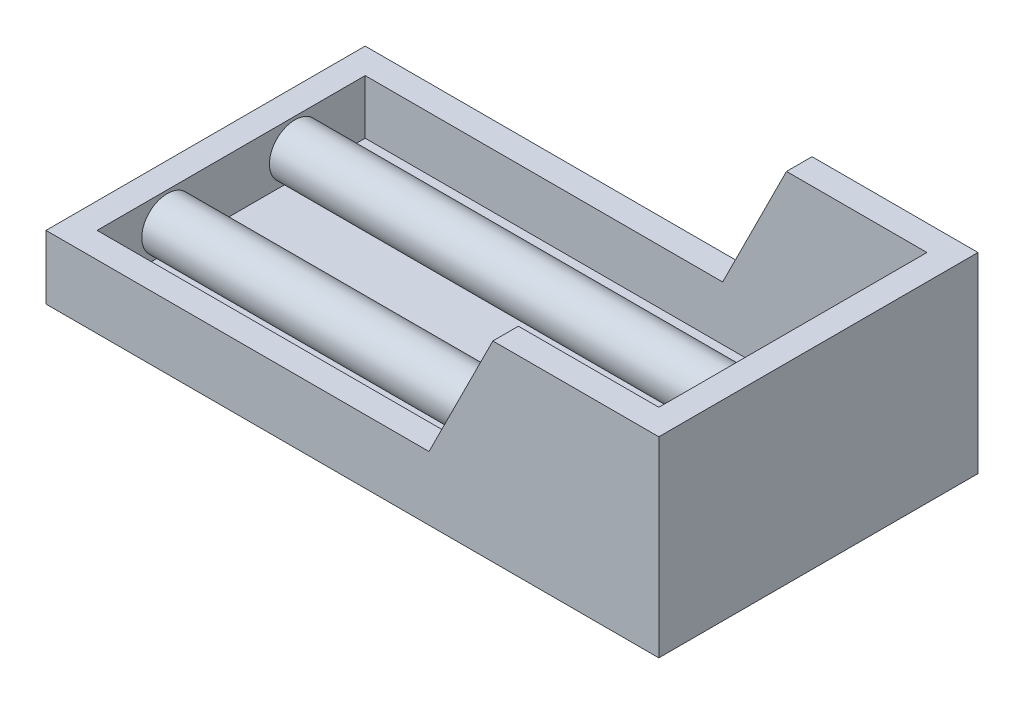
ISO-10303-21;
HEADER;
FILE_DESCRIPTION(('STEP AP214'),'2;1');
FILE_NAME('part.step','',(''),(''),'','','');
FILE_SCHEMA(('AUTOMOTIVE_DESIGN { 1 0 10303 214 1 1 1 1 }'));
ENDSEC;
DATA;
#1=APPLICATION_CONTEXT('core data for automotive mechanical design processes');
#2=APPLICATION_PROTOCOL_DEFINITION('international standard','automotive_design',2000,#1);
#3=PRODUCT_CONTEXT('',#1,'mechanical');
#4=PRODUCT('Part','Part','',(#3));
#5=PRODUCT_RELATED_PRODUCT_CATEGORY('part','',(#4));
#6=PRODUCT_DEFINITION_FORMATION('','',#4);
#7=PRODUCT_DEFINITION_CONTEXT('part definition',#1,'design');
#8=PRODUCT_DEFINITION('design','',#6,#7);
#9=PRODUCT_DEFINITION_SHAPE('','',#8);
#10=(LENGTH_UNIT() NAMED_UNIT(*) SI_UNIT(.MILLI.,.METRE.));
#11=(NAMED_UNIT(*) PLANE_ANGLE_UNIT() SI_UNIT($,.RADIAN.));
#12=(NAMED_UNIT(*) SI_UNIT($,.STERADIAN.) SOLID_ANGLE_UNIT());
#13=UNCERTAINTY_MEASURE_WITH_UNIT(LENGTH_MEASURE(1.E-05),#10,'distance_accuracy_value','');
#14=(GEOMETRIC_REPRESENTATION_CONTEXT(3) GLOBAL_UNCERTAINTY_ASSIGNED_CONTEXT((#13)) GLOBAL_UNIT_ASSIGNED_CONTEXT((#10,
#11,#12)) REPRESENTATION_CONTEXT('',''));
#15=CARTESIAN_POINT('',(0.,0.,0.));
#16=DIRECTION('',(0.,0.,1.));
#17=DIRECTION('',(1.,0.,0.));
#18=AXIS2_PLACEMENT_3D('',#15,#16,#17);
#19=CARTESIAN_POINT('',(-8.,2.75,-2.5));
#20=DIRECTION('',(-1.,0.,0.));
#21=DIRECTION('',(0.,0.,1.));
#22=AXIS2_PLACEMENT_3D('',#19,#20,#21);
#23=PLANE('',#22);
#24=CARTESIAN_POINT('',(-8.,2.75,-2.5));
#25=DIRECTION('',(1.,0.,0.));
#26=DIRECTION('',(0.,0.,1.));
#27=AXIS2_PLACEMENT_3D('',#24,#25,#26);
#28=CIRCLE('',#27,2.);
#29=CARTESIAN_POINT('',(-8.,2.75,-0.500000000000004));
#30=VERTEX_POINT('',#29);
#31=EDGE_CURVE('E57',#30,#30,#28,.T.);
#32=ORIENTED_EDGE('',*,*,#31,.F.);
#33=EDGE_LOOP('',(#32));
#34=FACE_BOUND('',#33,.T.);
#35=ADVANCED_FACE('F46',(#34),#23,.T.);
#36=CARTESIAN_POINT('',(41.6568542494924,2.75,-2.5));
#37=DIRECTION('',(-1.,0.,0.));
#38=DIRECTION('',(0.,0.,1.));
#39=AXIS2_PLACEMENT_3D('',#36,#37,#38);
#40=CYLINDRICAL_SURFACE('',#39,2.);
#41=CARTESIAN_POINT('',(35.,2.75,-2.5));
#42=DIRECTION('',(-1.,0.,0.));
#43=DIRECTION('',(0.,0.,1.));
#44=AXIS2_PLACEMENT_3D('',#41,#42,#43);
#45=CIRCLE('',#44,2.);
#46=CARTESIAN_POINT('',(35.,2.75,-0.500000000000004));
#47=VERTEX_POINT('',#46);
#48=EDGE_CURVE('E53',#47,#47,#45,.T.);
#49=ORIENTED_EDGE('',*,*,#48,.T.);
#50=EDGE_LOOP('',(#49));
#51=FACE_BOUND('',#50,.T.);
#52=ORIENTED_EDGE('',*,*,#31,.T.);
#53=EDGE_LOOP('',(#52));
#54=FACE_BOUND('',#53,.T.);
#55=ADVANCED_FACE('F64',(#51,#54),#40,.T.);
#56=CARTESIAN_POINT('',(36.,15.,-18.));
#57=DIRECTION('',(-1.,0.,0.));
#58=DIRECTION('',(0.,0.,1.));
#59=AXIS2_PLACEMENT_3D('',#56,#57,#58);
#60=PLANE('',#59);
#61=CARTESIAN_POINT('',(36.,2.75,-2.5));
#62=DIRECTION('',(-1.,0.,0.));
#63=DIRECTION('',(0.,0.,1.));
#64=AXIS2_PLACEMENT_3D('',#61,#62,#63);
#65=CIRCLE('',#64,1.);
#66=CARTESIAN_POINT('',(36.,2.75,-1.5));
#67=VERTEX_POINT('',#66);
#68=EDGE_CURVE('E11',#67,#67,#65,.F.);
#69=ORIENTED_EDGE('',*,*,#68,.T.);
#70=EDGE_LOOP('',(#69));
#71=FACE_BOUND('',#70,.T.);
#72=ADVANCED_FACE('F71',(#71),#60,.F.);
#73=CARTESIAN_POINT('',(35.,2.75,-2.5));
#74=DIRECTION('',(-1.,0.,0.));
#75=DIRECTION('',(0.,0.,1.));
#76=AXIS2_PLACEMENT_3D('',#73,#74,#75);
#77=TOROIDAL_SURFACE('',#76,1.,1.);
#78=ORIENTED_EDGE('',*,*,#68,.F.);
#79=EDGE_LOOP('',(#78));
#80=FACE_BOUND('',#79,.T.);
#81=ORIENTED_EDGE('',*,*,#48,.F.);
#82=EDGE_LOOP('',(#81));
#83=FACE_BOUND('',#82,.T.);
#84=ADVANCED_FACE('F48',(#80,#83),#77,.T.);
#85=CLOSED_SHELL('',(#35,#55,#72,#84));
#86=MANIFOLD_SOLID_BREP('B2',#85);
#87=CARTESIAN_POINT('',(-8.,2.75,-12.5));
#88=DIRECTION('',(1.,0.,0.));
#89=DIRECTION('',(0.,0.,-1.));
#90=AXIS2_PLACEMENT_3D('',#87,#88,#89);
#91=PLANE('',#90);
#92=CARTESIAN_POINT('',(-8.,2.75,-12.5));
#93=DIRECTION('',(1.,0.,0.));
#94=DIRECTION('',(0.,0.,-1.));
#95=AXIS2_PLACEMENT_3D('',#92,#93,#94);
#96=CIRCLE('',#95,2.);
#97=CARTESIAN_POINT('',(-8.,2.75,-14.5));
#98=VERTEX_POINT('',#97);
#99=EDGE_CURVE('E124',#98,#98,#96,.T.);
#100=ORIENTED_EDGE('',*,*,#99,.F.);
#101=EDGE_LOOP('',(#100));
#102=FACE_BOUND('',#101,.T.);
#103=ADVANCED_FACE('F113',(#102),#91,.F.);
#104=CARTESIAN_POINT('',(41.6568542494924,2.75,-12.5));
#105=DIRECTION('',(-1.,0.,0.));
#106=DIRECTION('',(0.,0.,1.));
#107=AXIS2_PLACEMENT_3D('',#104,#105,#106);
#108=CYLINDRICAL_SURFACE('',#107,2.);
#109=CARTESIAN_POINT('',(35.,2.75,-12.5));
#110=DIRECTION('',(-1.,0.,0.));
#111=DIRECTION('',(0.,0.,1.));
#112=AXIS2_PLACEMENT_3D('',#109,#110,#111);
#113=CIRCLE('',#112,2.);
#114=CARTESIAN_POINT('',(35.,2.75,-10.5));
#115=VERTEX_POINT('',#114);
#116=EDGE_CURVE('E120',#115,#115,#113,.T.);
#117=ORIENTED_EDGE('',*,*,#116,.T.);
#118=EDGE_LOOP('',(#117));
#119=FACE_BOUND('',#118,.T.);
#120=ORIENTED_EDGE('',*,*,#99,.T.);
#121=EDGE_LOOP('',(#120));
#122=FACE_BOUND('',#121,.T.);
#123=ADVANCED_FACE('F131',(#119,#122),#108,.T.);
#124=CARTESIAN_POINT('',(36.,15.,-18.));
#125=DIRECTION('',(-1.,0.,0.));
#126=DIRECTION('',(0.,0.,1.));
#127=AXIS2_PLACEMENT_3D('',#124,#125,#126);
#128=PLANE('',#127);
#129=CARTESIAN_POINT('',(36.,2.75,-12.5));
#130=DIRECTION('',(-1.,0.,0.));
#131=DIRECTION('',(0.,0.,1.));
#132=AXIS2_PLACEMENT_3D('',#129,#130,#131);
#133=CIRCLE('',#132,0.999999999999997);
#134=CARTESIAN_POINT('',(36.,2.75,-11.5));
#135=VERTEX_POINT('',#134);
#136=EDGE_CURVE('E45',#135,#135,#133,.F.);
#137=ORIENTED_EDGE('',*,*,#136,.T.);
#138=EDGE_LOOP('',(#137));
#139=FACE_BOUND('',#138,.T.);
#140=ADVANCED_FACE('F138',(#139),#128,.F.);
#141=CARTESIAN_POINT('',(35.,2.75,-12.5));
#142=DIRECTION('',(-1.,0.,0.));
#143=DIRECTION('',(0.,0.,1.));
#144=AXIS2_PLACEMENT_3D('',#141,#142,#143);
#145=DEGENERATE_TOROIDAL_SURFACE('',#144,0.999999999999997,1.,.T.);
#146=ORIENTED_EDGE('',*,*,#136,.F.);
#147=EDGE_LOOP('',(#146));
#148=FACE_BOUND('',#147,.T.);
#149=ORIENTED_EDGE('',*,*,#116,.F.);
#150=EDGE_LOOP('',(#149));
#151=FACE_BOUND('',#150,.T.);
#152=ADVANCED_FACE('F115',(#148,#151),#145,.T.);
#153=CLOSED_SHELL('',(#103,#123,#140,#152));
#154=MANIFOLD_SOLID_BREP('B6',#153);
#155=CARTESIAN_POINT('',(0.,15.,0.));
#156=DIRECTION('',(0.,1.,0.));
#157=DIRECTION('',(0.,0.,1.));
#158=AXIS2_PLACEMENT_3D('',#155,#156,#157);
#159=PLANE('',#158);
#160=DIRECTION('',(0.,0.,1.));
#161=VECTOR('',#160,1.);
#162=CARTESIAN_POINT('',(25.,15.,-20.));
#163=LINE('',#162,#161);
#164=CARTESIAN_POINT('',(25.,15.,-20.));
#165=VERTEX_POINT('',#164);
#166=CARTESIAN_POINT('',(25.,15.,-18.));
#167=VERTEX_POINT('',#166);
#168=EDGE_CURVE('E285',#165,#167,#163,.T.);
#169=ORIENTED_EDGE('',*,*,#168,.T.);
#170=DIRECTION('',(-1.,0.,0.));
#171=VECTOR('',#170,1.);
#172=CARTESIAN_POINT('',(-8.,15.,-18.));
#173=LINE('',#172,#171);
#174=CARTESIAN_POINT('',(36.,15.,-18.));
#175=VERTEX_POINT('',#174);
#176=EDGE_CURVE('E272',#175,#167,#173,.T.);
#177=ORIENTED_EDGE('',*,*,#176,.F.);
#178=DIRECTION('',(0.,0.,-1.));
#179=VECTOR('',#178,1.);
#180=CARTESIAN_POINT('',(36.,15.,-18.));
#181=LINE('',#180,#179);
#182=CARTESIAN_POINT('',(36.,15.,3.));
#183=VERTEX_POINT('',#182);
#184=EDGE_CURVE('E263',#183,#175,#181,.T.);
#185=ORIENTED_EDGE('',*,*,#184,.F.);
#186=DIRECTION('',(1.,0.,0.));
#187=VECTOR('',#186,1.);
#188=CARTESIAN_POINT('',(-8.,15.,3.));
#189=LINE('',#188,#187);
#190=CARTESIAN_POINT('',(25.,15.,3.));
#191=VERTEX_POINT('',#190);
#192=EDGE_CURVE('E286',#191,#183,#189,.T.);
#193=ORIENTED_EDGE('',*,*,#192,.F.);
#194=CARTESIAN_POINT('',(25.,15.,5.));
#195=VERTEX_POINT('',#194);
#196=EDGE_CURVE('E196',#191,#195,#163,.T.);
#197=ORIENTED_EDGE('',*,*,#196,.T.);
#198=DIRECTION('',(1.,0.,0.));
#199=VECTOR('',#198,1.);
#200=CARTESIAN_POINT('',(-10.,15.,5.));
#201=LINE('',#200,#199);
#202=CARTESIAN_POINT('',(38.,15.,5.));
#203=VERTEX_POINT('',#202);
#204=EDGE_CURVE('E328',#195,#203,#201,.T.);
#205=ORIENTED_EDGE('',*,*,#204,.T.);
#206=DIRECTION('',(0.,0.,-1.));
#207=VECTOR('',#206,1.);
#208=CARTESIAN_POINT('',(38.,15.,-20.));
#209=LINE('',#208,#207);
#210=CARTESIAN_POINT('',(38.,15.,-20.));
#211=VERTEX_POINT('',#210);
#212=EDGE_CURVE('E322',#203,#211,#209,.T.);
#213=ORIENTED_EDGE('',*,*,#212,.T.);
#214=DIRECTION('',(-1.,0.,0.));
#215=VECTOR('',#214,1.);
#216=CARTESIAN_POINT('',(-10.,15.,-20.));
#217=LINE('',#216,#215);
#218=EDGE_CURVE('E325',#211,#165,#217,.T.);
#219=ORIENTED_EDGE('',*,*,#218,.T.);
#220=EDGE_LOOP('',(#169,#177,#185,#193,#197,#205,#213,#219));
#221=FACE_BOUND('',#220,.T.);
#222=ADVANCED_FACE('F173',(#221),#159,.T.);
#223=CARTESIAN_POINT('',(25.,15.,-20.));
#224=DIRECTION('',(0.894427190999916,-0.447213595499958,0.));
#225=DIRECTION('',(0.447213595499958,0.894427190999916,0.));
#226=AXIS2_PLACEMENT_3D('',#223,#224,#225);
#227=PLANE('',#226);
#228=DIRECTION('',(-0.447213595499958,-0.894427190999916,0.));
#229=VECTOR('',#228,1.);
#230=CARTESIAN_POINT('',(25.,15.,-18.));
#231=LINE('',#230,#229);
#232=CARTESIAN_POINT('',(20.,5.,-18.));
#233=VERTEX_POINT('',#232);
#234=EDGE_CURVE('E301',#167,#233,#231,.T.);
#235=ORIENTED_EDGE('',*,*,#234,.F.);
#236=ORIENTED_EDGE('',*,*,#168,.F.);
#237=DIRECTION('',(0.447213595499958,0.894427190999916,0.));
#238=VECTOR('',#237,1.);
#239=CARTESIAN_POINT('',(25.,15.,-20.));
#240=LINE('',#239,#238);
#241=CARTESIAN_POINT('',(20.,5.,-20.));
#242=VERTEX_POINT('',#241);
#243=EDGE_CURVE('E307',#242,#165,#240,.T.);
#244=ORIENTED_EDGE('',*,*,#243,.F.);
#245=DIRECTION('',(0.,0.,1.));
#246=VECTOR('',#245,1.);
#247=CARTESIAN_POINT('',(20.,5.,-20.));
#248=LINE('',#247,#246);
#249=EDGE_CURVE('E317',#242,#233,#248,.T.);
#250=ORIENTED_EDGE('',*,*,#249,.T.);
#251=EDGE_LOOP('',(#235,#236,#244,#250));
#252=FACE_BOUND('',#251,.T.);
#253=ADVANCED_FACE('F380',(#252),#227,.F.);
#254=DIRECTION('',(0.447213595499958,0.894427190999916,0.));
#255=VECTOR('',#254,1.);
#256=CARTESIAN_POINT('',(25.,15.,3.));
#257=LINE('',#256,#255);
#258=CARTESIAN_POINT('',(20.,5.,3.));
#259=VERTEX_POINT('',#258);
#260=EDGE_CURVE('E280',#259,#191,#257,.T.);
#261=ORIENTED_EDGE('',*,*,#260,.F.);
#262=CARTESIAN_POINT('',(20.,5.,5.));
#263=VERTEX_POINT('',#262);
#264=EDGE_CURVE('E320',#259,#263,#248,.T.);
#265=ORIENTED_EDGE('',*,*,#264,.T.);
#266=DIRECTION('',(0.447213595499958,0.894427190999916,0.));
#267=VECTOR('',#266,1.);
#268=CARTESIAN_POINT('',(25.,15.,5.));
#269=LINE('',#268,#267);
#270=EDGE_CURVE('E308',#263,#195,#269,.T.);
#271=ORIENTED_EDGE('',*,*,#270,.T.);
#272=ORIENTED_EDGE('',*,*,#196,.F.);
#273=EDGE_LOOP('',(#261,#265,#271,#272));
#274=FACE_BOUND('',#273,.T.);
#275=ADVANCED_FACE('F363',(#274),#227,.F.);
#276=CARTESIAN_POINT('',(20.,5.,-20.));
#277=DIRECTION('',(0.,-1.,0.));
#278=DIRECTION('',(1.,0.,0.));
#279=AXIS2_PLACEMENT_3D('',#276,#277,#278);
#280=PLANE('',#279);
#281=DIRECTION('',(-1.,0.,0.));
#282=VECTOR('',#281,1.);
#283=CARTESIAN_POINT('',(20.,5.,-18.));
#284=LINE('',#283,#282);
#285=CARTESIAN_POINT('',(-8.,5.,-18.));
#286=VERTEX_POINT('',#285);
#287=EDGE_CURVE('E111',#233,#286,#284,.T.);
#288=ORIENTED_EDGE('',*,*,#287,.F.);
#289=ORIENTED_EDGE('',*,*,#249,.F.);
#290=DIRECTION('',(1.,0.,0.));
#291=VECTOR('',#290,1.);
#292=CARTESIAN_POINT('',(20.,5.,-20.));
#293=LINE('',#292,#291);
#294=CARTESIAN_POINT('',(-10.,5.,-20.));
#295=VERTEX_POINT('',#294);
#296=EDGE_CURVE('E304',#295,#242,#293,.T.);
#297=ORIENTED_EDGE('',*,*,#296,.F.);
#298=DIRECTION('',(0.,0.,1.));
#299=VECTOR('',#298,1.);
#300=CARTESIAN_POINT('',(-10.,5.,-20.));
#301=LINE('',#300,#299);
#302=CARTESIAN_POINT('',(-10.,5.,5.));
#303=VERTEX_POINT('',#302);
#304=EDGE_CURVE('E311',#295,#303,#301,.T.);
#305=ORIENTED_EDGE('',*,*,#304,.T.);
#306=DIRECTION('',(1.,0.,0.));
#307=VECTOR('',#306,1.);
#308=CARTESIAN_POINT('',(20.,5.,5.));
#309=LINE('',#308,#307);
#310=EDGE_CURVE('E303',#303,#263,#309,.T.);
#311=ORIENTED_EDGE('',*,*,#310,.T.);
#312=ORIENTED_EDGE('',*,*,#264,.F.);
#313=DIRECTION('',(1.,0.,0.));
#314=VECTOR('',#313,1.);
#315=CARTESIAN_POINT('',(20.,5.,3.));
#316=LINE('',#315,#314);
#317=CARTESIAN_POINT('',(-8.,5.,3.));
#318=VERTEX_POINT('',#317);
#319=EDGE_CURVE('E349',#318,#259,#316,.T.);
#320=ORIENTED_EDGE('',*,*,#319,.F.);
#321=DIRECTION('',(0.,0.,1.));
#322=VECTOR('',#321,1.);
#323=CARTESIAN_POINT('',(-8.,5.,-20.));
#324=LINE('',#323,#322);
#325=EDGE_CURVE('E181',#286,#318,#324,.T.);
#326=ORIENTED_EDGE('',*,*,#325,.F.);
#327=EDGE_LOOP('',(#288,#289,#297,#305,#311,#312,#320,#326));
#328=FACE_BOUND('',#327,.T.);
#329=ADVANCED_FACE('F359',(#328),#280,.F.);
#330=CARTESIAN_POINT('',(38.,15.,-20.));
#331=DIRECTION('',(-1.,0.,0.));
#332=DIRECTION('',(0.,0.,1.));
#333=AXIS2_PLACEMENT_3D('',#330,#331,#332);
#334=PLANE('',#333);
#335=DIRECTION('',(0.,0.,-1.));
#336=VECTOR('',#335,1.);
#337=CARTESIAN_POINT('',(38.,0.,-20.));
#338=LINE('',#337,#336);
#339=CARTESIAN_POINT('',(38.,0.,5.));
#340=VERTEX_POINT('',#339);
#341=CARTESIAN_POINT('',(38.,0.,-20.));
#342=VERTEX_POINT('',#341);
#343=EDGE_CURVE('E316',#340,#342,#338,.T.);
#344=ORIENTED_EDGE('',*,*,#343,.T.);
#345=DIRECTION('',(0.,-1.,0.));
#346=VECTOR('',#345,1.);
#347=CARTESIAN_POINT('',(38.,15.,-20.));
#348=LINE('',#347,#346);
#349=EDGE_CURVE('E346',#211,#342,#348,.T.);
#350=ORIENTED_EDGE('',*,*,#349,.F.);
#351=ORIENTED_EDGE('',*,*,#212,.F.);
#352=DIRECTION('',(0.,-1.,0.));
#353=VECTOR('',#352,1.);
#354=CARTESIAN_POINT('',(38.,15.,5.));
#355=LINE('',#354,#353);
#356=EDGE_CURVE('E330',#203,#340,#355,.T.);
#357=ORIENTED_EDGE('',*,*,#356,.T.);
#358=EDGE_LOOP('',(#344,#350,#351,#357));
#359=FACE_BOUND('',#358,.T.);
#360=ADVANCED_FACE('F175',(#359),#334,.F.);
#361=CARTESIAN_POINT('',(-10.,15.,-20.));
#362=DIRECTION('',(0.,0.,1.));
#363=DIRECTION('',(1.,0.,0.));
#364=AXIS2_PLACEMENT_3D('',#361,#362,#363);
#365=PLANE('',#364);
#366=ORIENTED_EDGE('',*,*,#296,.T.);
#367=ORIENTED_EDGE('',*,*,#243,.T.);
#368=ORIENTED_EDGE('',*,*,#218,.F.);
#369=ORIENTED_EDGE('',*,*,#349,.T.);
#370=DIRECTION('',(-1.,0.,0.));
#371=VECTOR('',#370,1.);
#372=CARTESIAN_POINT('',(-10.,0.,-20.));
#373=LINE('',#372,#371);
#374=CARTESIAN_POINT('',(-10.,0.,-20.));
#375=VERTEX_POINT('',#374);
#376=EDGE_CURVE('E333',#342,#375,#373,.T.);
#377=ORIENTED_EDGE('',*,*,#376,.T.);
#378=DIRECTION('',(0.,-1.,0.));
#379=VECTOR('',#378,1.);
#380=CARTESIAN_POINT('',(-10.,15.,-20.));
#381=LINE('',#380,#379);
#382=EDGE_CURVE('E344',#295,#375,#381,.T.);
#383=ORIENTED_EDGE('',*,*,#382,.F.);
#384=EDGE_LOOP('',(#366,#367,#368,#369,#377,#383));
#385=FACE_BOUND('',#384,.T.);
#386=ADVANCED_FACE('F375',(#385),#365,.F.);
#387=CARTESIAN_POINT('',(-10.,15.,-20.));
#388=DIRECTION('',(1.,0.,0.));
#389=DIRECTION('',(0.,0.,-1.));
#390=AXIS2_PLACEMENT_3D('',#387,#388,#389);
#391=PLANE('',#390);
#392=DIRECTION('',(0.,-1.,0.));
#393=VECTOR('',#392,1.);
#394=CARTESIAN_POINT('',(-10.,15.,5.));
#395=LINE('',#394,#393);
#396=CARTESIAN_POINT('',(-10.,0.,5.));
#397=VERTEX_POINT('',#396);
#398=EDGE_CURVE('E342',#303,#397,#395,.T.);
#399=ORIENTED_EDGE('',*,*,#398,.F.);
#400=ORIENTED_EDGE('',*,*,#304,.F.);
#401=ORIENTED_EDGE('',*,*,#382,.T.);
#402=DIRECTION('',(0.,0.,1.));
#403=VECTOR('',#402,1.);
#404=CARTESIAN_POINT('',(-10.,0.,-20.));
#405=LINE('',#404,#403);
#406=EDGE_CURVE('E336',#375,#397,#405,.T.);
#407=ORIENTED_EDGE('',*,*,#406,.T.);
#408=EDGE_LOOP('',(#399,#400,#401,#407));
#409=FACE_BOUND('',#408,.T.);
#410=ADVANCED_FACE('F384',(#409),#391,.F.);
#411=CARTESIAN_POINT('',(-10.,15.,5.));
#412=DIRECTION('',(0.,0.,-1.));
#413=DIRECTION('',(-1.,0.,0.));
#414=AXIS2_PLACEMENT_3D('',#411,#412,#413);
#415=PLANE('',#414);
#416=ORIENTED_EDGE('',*,*,#204,.F.);
#417=ORIENTED_EDGE('',*,*,#270,.F.);
#418=ORIENTED_EDGE('',*,*,#310,.F.);
#419=ORIENTED_EDGE('',*,*,#398,.T.);
#420=DIRECTION('',(1.,0.,0.));
#421=VECTOR('',#420,1.);
#422=CARTESIAN_POINT('',(-10.,0.,5.));
#423=LINE('',#422,#421);
#424=EDGE_CURVE('E326',#397,#340,#423,.T.);
#425=ORIENTED_EDGE('',*,*,#424,.T.);
#426=ORIENTED_EDGE('',*,*,#356,.F.);
#427=EDGE_LOOP('',(#416,#417,#418,#419,#425,#426));
#428=FACE_BOUND('',#427,.T.);
#429=ADVANCED_FACE('F369',(#428),#415,.F.);
#430=CARTESIAN_POINT('',(0.,0.,0.));
#431=DIRECTION('',(0.,1.,0.));
#432=DIRECTION('',(0.,0.,1.));
#433=AXIS2_PLACEMENT_3D('',#430,#431,#432);
#434=PLANE('',#433);
#435=ORIENTED_EDGE('',*,*,#343,.F.);
#436=ORIENTED_EDGE('',*,*,#424,.F.);
#437=ORIENTED_EDGE('',*,*,#406,.F.);
#438=ORIENTED_EDGE('',*,*,#376,.F.);
#439=EDGE_LOOP('',(#435,#436,#437,#438));
#440=FACE_BOUND('',#439,.T.);
#441=ADVANCED_FACE('F387',(#440),#434,.F.);
#442=CARTESIAN_POINT('',(-8.,15.,-18.));
#443=DIRECTION('',(0.,0.,1.));
#444=DIRECTION('',(1.,0.,0.));
#445=AXIS2_PLACEMENT_3D('',#442,#443,#444);
#446=PLANE('',#445);
#447=ORIENTED_EDGE('',*,*,#234,.T.);
#448=ORIENTED_EDGE('',*,*,#287,.T.);
#449=DIRECTION('',(0.,-1.,0.));
#450=VECTOR('',#449,1.);
#451=CARTESIAN_POINT('',(-8.,15.,-18.));
#452=LINE('',#451,#450);
#453=CARTESIAN_POINT('',(-8.,0.75,-18.));
#454=VERTEX_POINT('',#453);
#455=EDGE_CURVE('E281',#286,#454,#452,.T.);
#456=ORIENTED_EDGE('',*,*,#455,.T.);
#457=DIRECTION('',(-1.,0.,0.));
#458=VECTOR('',#457,1.);
#459=CARTESIAN_POINT('',(-8.,0.75,-18.));
#460=LINE('',#459,#458);
#461=CARTESIAN_POINT('',(36.,0.75,-18.));
#462=VERTEX_POINT('',#461);
#463=EDGE_CURVE('E279',#462,#454,#460,.T.);
#464=ORIENTED_EDGE('',*,*,#463,.F.);
#465=DIRECTION('',(0.,-1.,0.));
#466=VECTOR('',#465,1.);
#467=CARTESIAN_POINT('',(36.,15.,-18.));
#468=LINE('',#467,#466);
#469=EDGE_CURVE('E267',#175,#462,#468,.T.);
#470=ORIENTED_EDGE('',*,*,#469,.F.);
#471=ORIENTED_EDGE('',*,*,#176,.T.);
#472=EDGE_LOOP('',(#447,#448,#456,#464,#470,#471));
#473=FACE_BOUND('',#472,.T.);
#474=ADVANCED_FACE('F276',(#473),#446,.T.);
#475=CARTESIAN_POINT('',(-8.,15.,-18.));
#476=DIRECTION('',(1.,0.,0.));
#477=DIRECTION('',(0.,0.,-1.));
#478=AXIS2_PLACEMENT_3D('',#475,#476,#477);
#479=PLANE('',#478);
#480=ORIENTED_EDGE('',*,*,#325,.T.);
#481=DIRECTION('',(0.,-1.,0.));
#482=VECTOR('',#481,1.);
#483=CARTESIAN_POINT('',(-8.,15.,3.));
#484=LINE('',#483,#482);
#485=CARTESIAN_POINT('',(-8.,0.75,3.));
#486=VERTEX_POINT('',#485);
#487=EDGE_CURVE('E188',#318,#486,#484,.T.);
#488=ORIENTED_EDGE('',*,*,#487,.T.);
#489=DIRECTION('',(0.,0.,1.));
#490=VECTOR('',#489,1.);
#491=CARTESIAN_POINT('',(-8.,0.75,-18.));
#492=LINE('',#491,#490);
#493=EDGE_CURVE('E293',#454,#486,#492,.T.);
#494=ORIENTED_EDGE('',*,*,#493,.F.);
#495=ORIENTED_EDGE('',*,*,#455,.F.);
#496=EDGE_LOOP('',(#480,#488,#494,#495));
#497=FACE_BOUND('',#496,.T.);
#498=ADVANCED_FACE('F354',(#497),#479,.T.);
#499=CARTESIAN_POINT('',(-8.,15.,3.));
#500=DIRECTION('',(0.,0.,-1.));
#501=DIRECTION('',(-1.,0.,0.));
#502=AXIS2_PLACEMENT_3D('',#499,#500,#501);
#503=PLANE('',#502);
#504=ORIENTED_EDGE('',*,*,#260,.T.);
#505=ORIENTED_EDGE('',*,*,#192,.T.);
#506=DIRECTION('',(0.,-1.,0.));
#507=VECTOR('',#506,1.);
#508=CARTESIAN_POINT('',(36.,15.,3.));
#509=LINE('',#508,#507);
#510=CARTESIAN_POINT('',(36.,0.75,3.));
#511=VERTEX_POINT('',#510);
#512=EDGE_CURVE('E270',#183,#511,#509,.T.);
#513=ORIENTED_EDGE('',*,*,#512,.T.);
#514=DIRECTION('',(1.,0.,0.));
#515=VECTOR('',#514,1.);
#516=CARTESIAN_POINT('',(-8.,0.75,3.));
#517=LINE('',#516,#515);
#518=EDGE_CURVE('E273',#486,#511,#517,.T.);
#519=ORIENTED_EDGE('',*,*,#518,.F.);
#520=ORIENTED_EDGE('',*,*,#487,.F.);
#521=ORIENTED_EDGE('',*,*,#319,.T.);
#522=EDGE_LOOP('',(#504,#505,#513,#519,#520,#521));
#523=FACE_BOUND('',#522,.T.);
#524=ADVANCED_FACE('F361',(#523),#503,.T.);
#525=CARTESIAN_POINT('',(36.,15.,-18.));
#526=DIRECTION('',(-1.,0.,0.));
#527=DIRECTION('',(0.,0.,1.));
#528=AXIS2_PLACEMENT_3D('',#525,#526,#527);
#529=PLANE('',#528);
#530=DIRECTION('',(0.,0.,-1.));
#531=VECTOR('',#530,1.);
#532=CARTESIAN_POINT('',(36.,0.75,-18.));
#533=LINE('',#532,#531);
#534=EDGE_CURVE('E290',#511,#462,#533,.T.);
#535=ORIENTED_EDGE('',*,*,#534,.F.);
#536=ORIENTED_EDGE('',*,*,#512,.F.);
#537=ORIENTED_EDGE('',*,*,#184,.T.);
#538=ORIENTED_EDGE('',*,*,#469,.T.);
#539=EDGE_LOOP('',(#535,#536,#537,#538));
#540=FACE_BOUND('',#539,.T.);
#541=ADVANCED_FACE('F266',(#540),#529,.T.);
#542=CARTESIAN_POINT('',(0.,0.75,0.));
#543=DIRECTION('',(0.,1.,0.));
#544=DIRECTION('',(0.,0.,1.));
#545=AXIS2_PLACEMENT_3D('',#542,#543,#544);
#546=PLANE('',#545);
#547=ORIENTED_EDGE('',*,*,#534,.T.);
#548=ORIENTED_EDGE('',*,*,#463,.T.);
#549=ORIENTED_EDGE('',*,*,#493,.T.);
#550=ORIENTED_EDGE('',*,*,#518,.T.);
#551=EDGE_LOOP('',(#547,#548,#549,#550));
#552=FACE_BOUND('',#551,.T.);
#553=ADVANCED_FACE('F406',(#552),#546,.T.);
#554=CLOSED_SHELL('',(#222,#253,#275,#329,#360,#386,#410,#429,#441,#474,#498,#524,#541,#553));
#555=MANIFOLD_SOLID_BREP('B40',#554);
#556=ADVANCED_BREP_SHAPE_REPRESENTATION('',(#18,#86,#154,#555),#14);
#557=SHAPE_DEFINITION_REPRESENTATION(#9,#556);
ENDSEC;
END-ISO-10303-21;
